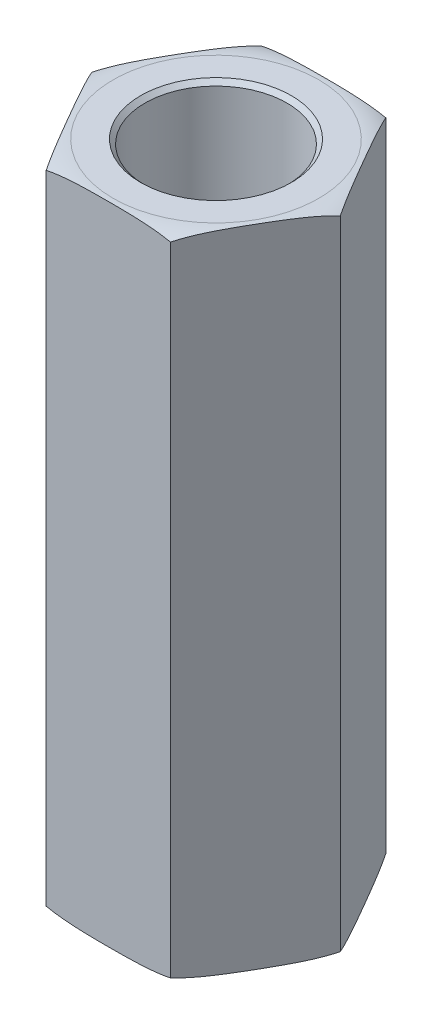
ISO-10303-21;
HEADER;
FILE_DESCRIPTION(('STEP AP214'),'2;1');
FILE_NAME('part.step','',(''),(''),'','','');
FILE_SCHEMA(('AUTOMOTIVE_DESIGN { 1 0 10303 214 1 1 1 1 }'));
ENDSEC;
DATA;
#1=APPLICATION_CONTEXT('core data for automotive mechanical design processes');
#2=APPLICATION_PROTOCOL_DEFINITION('international standard','automotive_design',2000,#1);
#3=PRODUCT_CONTEXT('',#1,'mechanical');
#4=PRODUCT('Part','Part','',(#3));
#5=PRODUCT_RELATED_PRODUCT_CATEGORY('part','',(#4));
#6=PRODUCT_DEFINITION_FORMATION('','',#4);
#7=PRODUCT_DEFINITION_CONTEXT('part definition',#1,'design');
#8=PRODUCT_DEFINITION('design','',#6,#7);
#9=PRODUCT_DEFINITION_SHAPE('','',#8);
#10=(LENGTH_UNIT() NAMED_UNIT(*) SI_UNIT(.MILLI.,.METRE.));
#11=(NAMED_UNIT(*) PLANE_ANGLE_UNIT() SI_UNIT($,.RADIAN.));
#12=(NAMED_UNIT(*) SI_UNIT($,.STERADIAN.) SOLID_ANGLE_UNIT());
#13=UNCERTAINTY_MEASURE_WITH_UNIT(LENGTH_MEASURE(1.E-05),#10,'distance_accuracy_value','');
#14=(GEOMETRIC_REPRESENTATION_CONTEXT(3) GLOBAL_UNCERTAINTY_ASSIGNED_CONTEXT((#13)) GLOBAL_UNIT_ASSIGNED_CONTEXT((#10,
#11,#12)) REPRESENTATION_CONTEXT('',''));
#15=CARTESIAN_POINT('',(0.,0.,0.));
#16=DIRECTION('',(0.,0.,1.));
#17=DIRECTION('',(1.,0.,0.));
#18=AXIS2_PLACEMENT_3D('',#15,#16,#17);
#19=CARTESIAN_POINT('',(3.66617420935412,9.525,0.));
#20=DIRECTION('',(-0.866025403784439,0.,0.5));
#21=DIRECTION('',(0.5,0.,0.866025403784439));
#22=AXIS2_PLACEMENT_3D('',#19,#20,#21);
#23=PLANE('',#22);
#24=DIRECTION('',(0.,1.,0.));
#25=VECTOR('',#24,1.);
#26=CARTESIAN_POINT('',(1.83308710467705,9.525,-3.175));
#27=LINE('',#26,#25);
#28=CARTESIAN_POINT('',(1.83308710467705,-9.398,-3.175));
#29=VERTEX_POINT('',#28);
#30=CARTESIAN_POINT('',(1.83308710467706,9.398,-3.175));
#31=VERTEX_POINT('',#30);
#32=EDGE_CURVE('E143',#29,#31,#27,.T.);
#33=ORIENTED_EDGE('',*,*,#32,.T.);
#34=CARTESIAN_POINT('',(3.66617420935412,9.398,0.));
#35=CARTESIAN_POINT('',(3.62797961467395,9.41390141489969,-0.0661549785605542));
#36=CARTESIAN_POINT('',(3.58956810864157,9.4274886076105,-0.132685658603869));
#37=CARTESIAN_POINT('',(3.51249051795711,9.45081619794021,-0.266187961794349));
#38=CARTESIAN_POINT('',(3.47382473049847,9.46056047713974,-0.333159070187379));
#39=CARTESIAN_POINT('',(3.39641631867874,9.4769966530451,-0.467234372392366));
#40=CARTESIAN_POINT('',(3.35767399633313,9.48369453286691,-0.534338043098168));
#41=CARTESIAN_POINT('',(3.28009834620114,9.4947767572932,-0.668703010556962));
#42=CARTESIAN_POINT('',(3.24126499587772,9.49916045047396,-0.735964346345247));
#43=CARTESIAN_POINT('',(3.16354065964316,9.50624030042628,-0.870586845688074));
#44=CARTESIAN_POINT('',(3.12464965374477,9.50893552375912,-0.937948043861543));
#45=CARTESIAN_POINT('',(3.04685144594594,9.51315319837134,-1.07269849250692));
#46=CARTESIAN_POINT('',(3.00794424351971,9.51467560802717,-1.14008774388952));
#47=CARTESIAN_POINT('',(2.93051517598875,9.51692270588903,-1.27419882283583));
#48=CARTESIAN_POINT('',(2.89199336248936,9.51765524681809,-1.34092056101645));
#49=CARTESIAN_POINT('',(2.81494778346146,9.51857673025742,-1.47436741839135));
#50=CARTESIAN_POINT('',(2.77642401791441,9.51876566589491,-1.5410925376177));
#51=CARTESIAN_POINT('',(2.69935964431015,9.51866599668056,-1.67457194815376));
#52=CARTESIAN_POINT('',(2.66081903631824,9.51837718117656,-1.74132623935034));
#53=CARTESIAN_POINT('',(2.58373908085332,9.517221986219,-1.87483263846072));
#54=CARTESIAN_POINT('',(2.54519973341248,9.51635559703857,-1.94158474631881));
#55=CARTESIAN_POINT('',(2.46812969629774,9.51378619406564,-2.07507396634277));
#56=CARTESIAN_POINT('',(2.42959900625968,9.51208322716166,-2.14181107913937));
#57=CARTESIAN_POINT('',(2.35255651340912,9.50743872297261,-2.27525259109831));
#58=CARTESIAN_POINT('',(2.31404470975446,9.50449724713581,-2.34195699171929));
#59=CARTESIAN_POINT('',(2.25084206239948,9.49821741247489,-2.45142718811098));
#60=CARTESIAN_POINT('',(2.22613849337013,9.49539801104633,-2.4942150247981));
#61=CARTESIAN_POINT('',(2.1767694527223,9.48886967943037,-2.57972471152106));
#62=CARTESIAN_POINT('',(2.15210397034186,9.48516108091391,-2.62244658019719));
#63=CARTESIAN_POINT('',(2.10282753811698,9.4766802711497,-2.70779586442641));
#64=CARTESIAN_POINT('',(2.07821657107531,9.47190846570085,-2.75042330976598));
#65=CARTESIAN_POINT('',(2.02900094683551,9.4610987712516,-2.83566727147553));
#66=CARTESIAN_POINT('',(2.00439646085464,9.45505773130843,-2.87828349128851));
#67=CARTESIAN_POINT('',(1.95527325900934,9.44151383541612,-2.96336737271503));
#68=CARTESIAN_POINT('',(1.93075459617615,9.43401019780297,-3.00583494247578));
#69=CARTESIAN_POINT('',(1.88182157373171,9.41732035070844,-3.09058942351744));
#70=CARTESIAN_POINT('',(1.85740744053269,9.40813149780328,-3.1328759426409));
#71=CARTESIAN_POINT('',(1.83308710467706,9.398,-3.175));
#72=B_SPLINE_CURVE_WITH_KNOTS('',3,(#34,#35,#36,#37,#38,#39,#40,#41,#42,#43,#44,#45,#46,#47,#48,
#49,#50,#51,#52,#53,#54,#55,#56,#57,#58,#59,#60,#61,#62,#63,#64,#65,#66,#67,#68,#69,#70,#71),
.UNSPECIFIED.,.F.,.F.,(4,2,2,2,2,2,2,2,2,2,2,2,2,2,2,2,2,2,4),(0.,0.233977307817935,
0.467717675040681,0.70099697355748,0.934341903229723,1.16781571967236,1.40129782179821,
1.63243665809665,1.86357841666612,2.09482211846288,2.32606971471488,2.5573043514739,
2.78852751694405,2.93698369265081,3.08538458004469,3.23372892334581,3.3824459854661,
3.53124274626083,3.68027493713586),.UNSPECIFIED.);
#73=CARTESIAN_POINT('',(3.66617420935412,9.398,0.));
#74=VERTEX_POINT('',#73);
#75=EDGE_CURVE('E97',#74,#31,#72,.T.);
#76=ORIENTED_EDGE('',*,*,#75,.F.);
#77=DIRECTION('',(0.,1.,0.));
#78=VECTOR('',#77,1.);
#79=CARTESIAN_POINT('',(3.66617420935412,9.525,0.));
#80=LINE('',#79,#78);
#81=CARTESIAN_POINT('',(3.66617420935412,-9.398,0.));
#82=VERTEX_POINT('',#81);
#83=EDGE_CURVE('E145',#74,#82,#80,.F.);
#84=ORIENTED_EDGE('',*,*,#83,.T.);
#85=CARTESIAN_POINT('',(1.83308710467705,-9.398,-3.17500000000001));
#86=CARTESIAN_POINT('',(1.87128169935722,-9.41390141489968,-3.10884502143945));
#87=CARTESIAN_POINT('',(1.9096932053896,-9.4274886076105,-3.04231434139614));
#88=CARTESIAN_POINT('',(1.98677079607406,-9.4508161979402,-2.90881203820566));
#89=CARTESIAN_POINT('',(2.0254365835327,-9.46056047713973,-2.84184092981263));
#90=CARTESIAN_POINT('',(2.10284499535243,-9.47699665304509,-2.70776562760765));
#91=CARTESIAN_POINT('',(2.14158731769803,-9.48369453286691,-2.64066195690184));
#92=CARTESIAN_POINT('',(2.21916296783002,-9.49477675729319,-2.50629698944305));
#93=CARTESIAN_POINT('',(2.25799631815344,-9.49916045047396,-2.43903565365477));
#94=CARTESIAN_POINT('',(2.335720654388,-9.50624030042628,-2.30441315431194));
#95=CARTESIAN_POINT('',(2.37461166028639,-9.50893552375912,-2.23705195613848));
#96=CARTESIAN_POINT('',(2.45240986808522,-9.51315319837134,-2.10230150749311));
#97=CARTESIAN_POINT('',(2.49131707051145,-9.51467560802717,-2.0349122561105));
#98=CARTESIAN_POINT('',(2.56874613804241,-9.51692270588903,-1.9008011771642));
#99=CARTESIAN_POINT('',(2.6072679515418,-9.51765524681809,-1.83407943898357));
#100=CARTESIAN_POINT('',(2.6843135305697,-9.51857673025742,-1.70063258160867));
#101=CARTESIAN_POINT('',(2.72283729611674,-9.51876566589491,-1.63390746238233));
#102=CARTESIAN_POINT('',(2.79990166972101,-9.51866599668056,-1.50042805184627));
#103=CARTESIAN_POINT('',(2.83844227771292,-9.51837718117656,-1.43367376064969));
#104=CARTESIAN_POINT('',(2.91552223317783,-9.517221986219,-1.30016736153931));
#105=CARTESIAN_POINT('',(2.95406158061867,-9.51635559703857,-1.23341525368122));
#106=CARTESIAN_POINT('',(3.03113161773342,-9.51378619406564,-1.09992603365727));
#107=CARTESIAN_POINT('',(3.06966230777147,-9.51208322716166,-1.03318892086067));
#108=CARTESIAN_POINT('',(3.14670480062203,-9.50743872297261,-0.899747408901733));
#109=CARTESIAN_POINT('',(3.18521660427669,-9.50449724713582,-0.83304300828075));
#110=CARTESIAN_POINT('',(3.24841925163167,-9.49821741247489,-0.723572811889063));
#111=CARTESIAN_POINT('',(3.27312282066102,-9.49539801104633,-0.680784975201942));
#112=CARTESIAN_POINT('',(3.32249186130885,-9.48886967943037,-0.595275288478971));
#113=CARTESIAN_POINT('',(3.3471573436893,-9.48516108091391,-0.552553419802841));
#114=CARTESIAN_POINT('',(3.39643377591418,-9.4766802711497,-0.46720413557362));
#115=CARTESIAN_POINT('',(3.42104474295585,-9.47190846570085,-0.424576690234039));
#116=CARTESIAN_POINT('',(3.47026036719565,-9.4610987712516,-0.339332728524487));
#117=CARTESIAN_POINT('',(3.49486485317652,-9.45505773130843,-0.296716508711511));
#118=CARTESIAN_POINT('',(3.54398805502183,-9.44151383541613,-0.211632627284978));
#119=CARTESIAN_POINT('',(3.56850671785502,-9.43401019780297,-0.169165057524231));
#120=CARTESIAN_POINT('',(3.61743974029946,-9.41732035070845,-0.08441057648256));
#121=CARTESIAN_POINT('',(3.64185387349848,-9.40813149780329,-0.0421240573591054));
#122=CARTESIAN_POINT('',(3.66617420935412,-9.398,0.));
#123=B_SPLINE_CURVE_WITH_KNOTS('',3,(#85,#86,#87,#88,#89,#90,#91,#92,#93,#94,#95,#96,#97,#98,
#99,#100,#101,#102,#103,#104,#105,#106,#107,#108,#109,#110,#111,#112,#113,#114,#115,#116,#117,
#118,#119,#120,#121,#122),.UNSPECIFIED.,.F.,.F.,(4,2,2,2,2,2,2,2,2,2,2,2,2,2,2,2,2,2,4),(0.,
0.233977307817932,0.467717675040674,0.700996973557469,0.934341903229708,1.16781571967234,
1.40129782179818,1.63243665809662,1.86357841666608,2.09482211846285,2.32606971471484,
2.55730435147386,2.78852751694401,2.93698369265077,3.08538458004466,3.23372892334579,
3.38244598546609,3.53124274626083,3.68027493713586),.UNSPECIFIED.);
#124=EDGE_CURVE('E221',#29,#82,#123,.T.);
#125=ORIENTED_EDGE('',*,*,#124,.F.);
#126=EDGE_LOOP('',(#33,#76,#84,#125));
#127=FACE_BOUND('',#126,.T.);
#128=ADVANCED_FACE('F17',(#127),#23,.F.);
#129=CARTESIAN_POINT('',(1.83308710467706,9.525,3.17499999999999));
#130=DIRECTION('',(-0.866025403784439,0.,-0.5));
#131=DIRECTION('',(-0.5,0.,0.866025403784439));
#132=AXIS2_PLACEMENT_3D('',#129,#130,#131);
#133=PLANE('',#132);
#134=ORIENTED_EDGE('',*,*,#83,.F.);
#135=CARTESIAN_POINT('',(1.83308710467706,9.398,3.17499999999999));
#136=CARTESIAN_POINT('',(1.87128169935724,9.41390141489969,3.10884502143943));
#137=CARTESIAN_POINT('',(1.90969320538961,9.4274886076105,3.04231434139612));
#138=CARTESIAN_POINT('',(1.98677079607407,9.45081619794021,2.90881203820564));
#139=CARTESIAN_POINT('',(2.02543658353271,9.46056047713974,2.84184092981261));
#140=CARTESIAN_POINT('',(2.10284499535245,9.4769966530451,2.70776562760762));
#141=CARTESIAN_POINT('',(2.14158731769805,9.48369453286691,2.64066195690182));
#142=CARTESIAN_POINT('',(2.21916296783004,9.4947767572932,2.50629698944302));
#143=CARTESIAN_POINT('',(2.25799631815346,9.49916045047396,2.43903565365474));
#144=CARTESIAN_POINT('',(2.33572065438802,9.50624030042628,2.30441315431191));
#145=CARTESIAN_POINT('',(2.37461166028641,9.50893552375912,2.23705195613844));
#146=CARTESIAN_POINT('',(2.45240986808524,9.51315319837134,2.10230150749307));
#147=CARTESIAN_POINT('',(2.49131707051148,9.51467560802717,2.03491225611046));
#148=CARTESIAN_POINT('',(2.56874613804244,9.51692270588903,1.90080117716416));
#149=CARTESIAN_POINT('',(2.60726795154182,9.51765524681809,1.83407943898353));
#150=CARTESIAN_POINT('',(2.68431353056973,9.51857673025742,1.70063258160863));
#151=CARTESIAN_POINT('',(2.72283729611677,9.51876566589491,1.63390746238228));
#152=CARTESIAN_POINT('',(2.79990166972104,9.51866599668056,1.50042805184622));
#153=CARTESIAN_POINT('',(2.83844227771295,9.51837718117656,1.43367376064964));
#154=CARTESIAN_POINT('',(2.91552223317786,9.517221986219,1.30016736153926));
#155=CARTESIAN_POINT('',(2.95406158061871,9.51635559703857,1.23341525368117));
#156=CARTESIAN_POINT('',(3.03113161773345,9.51378619406564,1.09992603365721));
#157=CARTESIAN_POINT('',(3.06966230777151,9.51208322716166,1.03318892086061));
#158=CARTESIAN_POINT('',(3.14670480062207,9.50743872297261,0.899747408901672));
#159=CARTESIAN_POINT('',(3.18521660427673,9.50449724713581,0.833043008280688));
#160=CARTESIAN_POINT('',(3.24841925163171,9.49821741247489,0.723572811889004));
#161=CARTESIAN_POINT('',(3.27312282066106,9.49539801104633,0.680784975201887));
#162=CARTESIAN_POINT('',(3.32249186130888,9.48886967943037,0.595275288478923));
#163=CARTESIAN_POINT('',(3.34715734368933,9.48516108091391,0.552553419802797));
#164=CARTESIAN_POINT('',(3.3964337759142,9.4766802711497,0.467204135573584));
#165=CARTESIAN_POINT('',(3.42104474295588,9.47190846570085,0.424576690234007));
#166=CARTESIAN_POINT('',(3.47026036719567,9.4610987712516,0.339332728524462));
#167=CARTESIAN_POINT('',(3.49486485317654,9.45505773130843,0.296716508711489));
#168=CARTESIAN_POINT('',(3.54398805502184,9.44151383541612,0.211632627284964));
#169=CARTESIAN_POINT('',(3.56850671785503,9.43401019780297,0.169165057524221));
#170=CARTESIAN_POINT('',(3.61743974029946,9.41732035070844,0.0844105764825579));
#171=CARTESIAN_POINT('',(3.64185387349848,9.40813149780328,0.042124057359107));
#172=CARTESIAN_POINT('',(3.66617420935412,9.398,0.));
#173=B_SPLINE_CURVE_WITH_KNOTS('',3,(#135,#136,#137,#138,#139,#140,#141,#142,#143,#144,#145,
#146,#147,#148,#149,#150,#151,#152,#153,#154,#155,#156,#157,#158,#159,#160,#161,#162,#163,#164,
#165,#166,#167,#168,#169,#170,#171,#172),.UNSPECIFIED.,.F.,.F.,(4,2,2,2,2,2,2,2,2,2,2,2,2,2,2,2,
2,2,4),(0.,0.233977307817936,0.467717675040682,0.700996973557482,0.934341903229727,
1.16781571967237,1.40129782179821,1.63243665809666,1.86357841666612,2.09482211846289,
2.32606971471489,2.55730435147391,2.78852751694406,2.93698369265081,3.08538458004469,
3.23372892334581,3.3824459854661,3.53124274626082,3.68027493713584),.UNSPECIFIED.);
#174=CARTESIAN_POINT('',(1.83308710467707,9.398,3.17499999999999));
#175=VERTEX_POINT('',#174);
#176=EDGE_CURVE('E214',#175,#74,#173,.T.);
#177=ORIENTED_EDGE('',*,*,#176,.F.);
#178=DIRECTION('',(0.,1.,0.));
#179=VECTOR('',#178,1.);
#180=CARTESIAN_POINT('',(1.83308710467707,9.525,3.17499999999999));
#181=LINE('',#180,#179);
#182=CARTESIAN_POINT('',(1.83308710467706,-9.398,3.17499999999999));
#183=VERTEX_POINT('',#182);
#184=EDGE_CURVE('E140',#175,#183,#181,.F.);
#185=ORIENTED_EDGE('',*,*,#184,.T.);
#186=CARTESIAN_POINT('',(3.66617420935412,-9.398,0.));
#187=CARTESIAN_POINT('',(3.62797961467395,-9.41390141489969,0.0661549785605599));
#188=CARTESIAN_POINT('',(3.58956810864157,-9.4274886076105,0.132685658603875));
#189=CARTESIAN_POINT('',(3.51249051795711,-9.45081619794021,0.266187961794355));
#190=CARTESIAN_POINT('',(3.47382473049847,-9.46056047713974,0.333159070187385));
#191=CARTESIAN_POINT('',(3.39641631867874,-9.4769966530451,0.467234372392373));
#192=CARTESIAN_POINT('',(3.35767399633313,-9.48369453286691,0.534338043098174));
#193=CARTESIAN_POINT('',(3.28009834620114,-9.4947767572932,0.668703010556968));
#194=CARTESIAN_POINT('',(3.24126499587772,-9.49916045047396,0.735964346345254));
#195=CARTESIAN_POINT('',(3.16354065964316,-9.50624030042628,0.87058684568808));
#196=CARTESIAN_POINT('',(3.12464965374477,-9.50893552375912,0.93794804386155));
#197=CARTESIAN_POINT('',(3.04685144594594,-9.51315319837134,1.07269849250692));
#198=CARTESIAN_POINT('',(3.00794424351971,-9.51467560802717,1.14008774388953));
#199=CARTESIAN_POINT('',(2.93051517598875,-9.51692270588903,1.27419882283583));
#200=CARTESIAN_POINT('',(2.89199336248936,-9.51765524681809,1.34092056101646));
#201=CARTESIAN_POINT('',(2.81494778346145,-9.51857673025742,1.47436741839136));
#202=CARTESIAN_POINT('',(2.77642401791441,-9.51876566589491,1.54109253761771));
#203=CARTESIAN_POINT('',(2.69935964431015,-9.51866599668056,1.67457194815377));
#204=CARTESIAN_POINT('',(2.66081903631824,-9.51837718117656,1.74132623935035));
#205=CARTESIAN_POINT('',(2.58373908085332,-9.517221986219,1.87483263846073));
#206=CARTESIAN_POINT('',(2.54519973341248,-9.51635559703857,1.94158474631882));
#207=CARTESIAN_POINT('',(2.46812969629773,-9.51378619406564,2.07507396634278));
#208=CARTESIAN_POINT('',(2.42959900625968,-9.51208322716166,2.14181107913938));
#209=CARTESIAN_POINT('',(2.35255651340911,-9.50743872297261,2.27525259109832));
#210=CARTESIAN_POINT('',(2.31404470975446,-9.50449724713581,2.3419569917193));
#211=CARTESIAN_POINT('',(2.25084206239948,-9.49821741247489,2.45142718811099));
#212=CARTESIAN_POINT('',(2.22613849337013,-9.49539801104633,2.4942150247981));
#213=CARTESIAN_POINT('',(2.1767694527223,-9.48886967943037,2.57972471152107));
#214=CARTESIAN_POINT('',(2.15210397034186,-9.48516108091391,2.62244658019719));
#215=CARTESIAN_POINT('',(2.10282753811698,-9.4766802711497,2.70779586442641));
#216=CARTESIAN_POINT('',(2.07821657107531,-9.47190846570085,2.75042330976598));
#217=CARTESIAN_POINT('',(2.02900094683551,-9.4610987712516,2.83566727147553));
#218=CARTESIAN_POINT('',(2.00439646085465,-9.45505773130843,2.8782834912885));
#219=CARTESIAN_POINT('',(1.95527325900934,-9.44151383541612,2.96336737271503));
#220=CARTESIAN_POINT('',(1.93075459617615,-9.43401019780296,3.00583494247577));
#221=CARTESIAN_POINT('',(1.88182157373172,-9.41732035070844,3.09058942351744));
#222=CARTESIAN_POINT('',(1.8574074405327,-9.40813149780329,3.13287594264089));
#223=CARTESIAN_POINT('',(1.83308710467706,-9.398,3.17499999999999));
#224=B_SPLINE_CURVE_WITH_KNOTS('',3,(#186,#187,#188,#189,#190,#191,#192,#193,#194,#195,#196,
#197,#198,#199,#200,#201,#202,#203,#204,#205,#206,#207,#208,#209,#210,#211,#212,#213,#214,#215,
#216,#217,#218,#219,#220,#221,#222,#223),.UNSPECIFIED.,.F.,.F.,(4,2,2,2,2,2,2,2,2,2,2,2,2,2,2,2,
2,2,4),(0.,0.233977307817936,0.467717675040682,0.700996973557481,0.934341903229725,
1.16781571967236,1.40129782179821,1.63243665809665,1.86357841666612,2.09482211846289,
2.32606971471488,2.55730435147391,2.78852751694405,2.93698369265081,3.08538458004468,
3.2337289233458,3.38244598546609,3.53124274626082,3.68027493713584),.UNSPECIFIED.);
#225=EDGE_CURVE('E240',#82,#183,#224,.T.);
#226=ORIENTED_EDGE('',*,*,#225,.F.);
#227=EDGE_LOOP('',(#134,#177,#185,#226));
#228=FACE_BOUND('',#227,.T.);
#229=ADVANCED_FACE('F218',(#228),#133,.F.);
#230=CARTESIAN_POINT('',(1.83308710467706,9.525,-3.175));
#231=DIRECTION('',(0.,0.,1.));
#232=DIRECTION('',(1.,0.,0.));
#233=AXIS2_PLACEMENT_3D('',#230,#231,#232);
#234=PLANE('',#233);
#235=DIRECTION('',(0.,1.,0.));
#236=VECTOR('',#235,1.);
#237=CARTESIAN_POINT('',(-1.83308710467707,9.525,-3.175));
#238=LINE('',#237,#236);
#239=CARTESIAN_POINT('',(-1.83308710467707,-9.39799999999999,-3.175));
#240=VERTEX_POINT('',#239);
#241=CARTESIAN_POINT('',(-1.83308710467706,9.398,-3.17500000000001));
#242=VERTEX_POINT('',#241);
#243=EDGE_CURVE('E104',#240,#242,#238,.T.);
#244=ORIENTED_EDGE('',*,*,#243,.T.);
#245=CARTESIAN_POINT('',(1.83308710467706,9.398,-3.175));
#246=CARTESIAN_POINT('',(1.73237579828683,9.41894001415179,-3.175));
#247=CARTESIAN_POINT('',(1.63096506893486,9.43588534953273,-3.175));
#248=CARTESIAN_POINT('',(1.42767146651469,9.46349716439842,-3.175));
#249=CARTESIAN_POINT('',(1.32579191427254,9.47418756587531,-3.175));
#250=CARTESIAN_POINT('',(1.12177634709137,9.49112804080793,-3.175));
#251=CARTESIAN_POINT('',(1.0196405664338,9.49738127071887,-3.175));
#252=CARTESIAN_POINT('',(0.815663681397375,9.50690280641833,-3.175));
#253=CARTESIAN_POINT('',(0.713823115514573,9.5101834044999,-3.175));
#254=CARTESIAN_POINT('',(0.510018485441651,9.51494548487028,-3.175));
#255=CARTESIAN_POINT('',(0.408054390577976,9.51642541008817,-3.175));
#256=CARTESIAN_POINT('',(0.20406020033787,9.51831468183793,-3.175));
#257=CARTESIAN_POINT('',(0.102030100168935,9.51872342414921,-3.175));
#258=CARTESIAN_POINT('',(-0.102030100168934,9.51872342414921,-3.175));
#259=CARTESIAN_POINT('',(-0.204060200337869,9.51831468183793,-3.175));
#260=CARTESIAN_POINT('',(-0.408054390577975,9.51642541008817,-3.175));
#261=CARTESIAN_POINT('',(-0.510018485441649,9.51494548487028,-3.175));
#262=CARTESIAN_POINT('',(-0.713823115514571,9.5101834044999,-3.175));
#263=CARTESIAN_POINT('',(-0.815663681397373,9.50690280641833,-3.175));
#264=CARTESIAN_POINT('',(-1.01964056643379,9.49738127071887,-3.175));
#265=CARTESIAN_POINT('',(-1.12177634709137,9.49112804080793,-3.175));
#266=CARTESIAN_POINT('',(-1.32579191427253,9.47418756587531,-3.175));
#267=CARTESIAN_POINT('',(-1.42767146651469,9.46349716439842,-3.175));
#268=CARTESIAN_POINT('',(-1.63096506893485,9.43588534953273,-3.175));
#269=CARTESIAN_POINT('',(-1.73237579828683,9.41894001415179,-3.175));
#270=CARTESIAN_POINT('',(-1.83308710467705,9.398,-3.17500000000001));
#271=B_SPLINE_CURVE_WITH_KNOTS('',3,(#245,#246,#247,#248,#249,#250,#251,#252,#253,#254,#255,
#256,#257,#258,#259,#260,#261,#262,#263,#264,#265,#266,#267,#268,#269,#270),.UNSPECIFIED.,.F.,
.F.,(4,2,2,2,2,2,2,2,2,2,2,2,4),(0.,0.308333242342807,0.615479423308234,0.922406891130008,
1.2280592962085,1.53397581645216,1.84006485747889,2.14615389850561,2.45207041874927,
2.75772282382776,3.06465029164954,3.37179647261496,3.68012971495777),.UNSPECIFIED.);
#272=EDGE_CURVE('E89',#31,#242,#271,.T.);
#273=ORIENTED_EDGE('',*,*,#272,.F.);
#274=ORIENTED_EDGE('',*,*,#32,.F.);
#275=CARTESIAN_POINT('',(-1.83308710467707,-9.39799999999999,-3.175));
#276=CARTESIAN_POINT('',(-1.73237579828684,-9.41894001415179,-3.175));
#277=CARTESIAN_POINT('',(-1.63096506893487,-9.43588534953273,-3.175));
#278=CARTESIAN_POINT('',(-1.4276714665147,-9.46349716439842,-3.175));
#279=CARTESIAN_POINT('',(-1.32579191427255,-9.47418756587531,-3.175));
#280=CARTESIAN_POINT('',(-1.12177634709138,-9.49112804080793,-3.175));
#281=CARTESIAN_POINT('',(-1.0196405664338,-9.49738127071887,-3.175));
#282=CARTESIAN_POINT('',(-0.81566368139738,-9.50690280641833,-3.175));
#283=CARTESIAN_POINT('',(-0.713823115514577,-9.5101834044999,-3.175));
#284=CARTESIAN_POINT('',(-0.510018485441654,-9.51494548487028,-3.175));
#285=CARTESIAN_POINT('',(-0.408054390577979,-9.51642541008817,-3.175));
#286=CARTESIAN_POINT('',(-0.204060200337872,-9.51831468183793,-3.175));
#287=CARTESIAN_POINT('',(-0.102030100168936,-9.51872342414921,-3.175));
#288=CARTESIAN_POINT('',(0.102030100168934,-9.51872342414921,-3.175));
#289=CARTESIAN_POINT('',(0.204060200337869,-9.51831468183793,-3.175));
#290=CARTESIAN_POINT('',(0.408054390577974,-9.51642541008817,-3.175));
#291=CARTESIAN_POINT('',(0.510018485441648,-9.51494548487028,-3.175));
#292=CARTESIAN_POINT('',(0.713823115514568,-9.5101834044999,-3.175));
#293=CARTESIAN_POINT('',(0.81566368139737,-9.50690280641833,-3.175));
#294=CARTESIAN_POINT('',(1.01964056643379,-9.49738127071887,-3.175));
#295=CARTESIAN_POINT('',(1.12177634709137,-9.49112804080794,-3.175));
#296=CARTESIAN_POINT('',(1.32579191427253,-9.47418756587531,-3.175));
#297=CARTESIAN_POINT('',(1.42767146651468,-9.46349716439843,-3.175));
#298=CARTESIAN_POINT('',(1.63096506893485,-9.43588534953273,-3.175));
#299=CARTESIAN_POINT('',(1.73237579828682,-9.41894001415179,-3.175));
#300=CARTESIAN_POINT('',(1.83308710467705,-9.398,-3.175));
#301=B_SPLINE_CURVE_WITH_KNOTS('',3,(#275,#276,#277,#278,#279,#280,#281,#282,#283,#284,#285,
#286,#287,#288,#289,#290,#291,#292,#293,#294,#295,#296,#297,#298,#299,#300),.UNSPECIFIED.,.F.,
.F.,(4,2,2,2,2,2,2,2,2,2,2,2,4),(0.,0.308333242342809,0.615479423308238,0.922406891130013,
1.22805929620851,1.53397581645217,1.8400648574789,2.14615389850562,2.45207041874928,
2.75772282382777,3.06465029164954,3.37179647261497,3.68012971495777),.UNSPECIFIED.);
#302=EDGE_CURVE('E106',#240,#29,#301,.T.);
#303=ORIENTED_EDGE('',*,*,#302,.F.);
#304=EDGE_LOOP('',(#244,#273,#274,#303));
#305=FACE_BOUND('',#304,.T.);
#306=ADVANCED_FACE('F105',(#305),#234,.F.);
#307=CARTESIAN_POINT('',(-1.83308710467707,9.525,3.175));
#308=DIRECTION('',(0.,0.,-1.));
#309=DIRECTION('',(-1.,0.,0.));
#310=AXIS2_PLACEMENT_3D('',#307,#308,#309);
#311=PLANE('',#310);
#312=ORIENTED_EDGE('',*,*,#184,.F.);
#313=CARTESIAN_POINT('',(-1.83308710467706,9.398,3.175));
#314=CARTESIAN_POINT('',(-1.73237579828684,9.41894001415179,3.175));
#315=CARTESIAN_POINT('',(-1.63096506893486,9.43588534953273,3.175));
#316=CARTESIAN_POINT('',(-1.42767146651469,9.46349716439843,3.175));
#317=CARTESIAN_POINT('',(-1.32579191427254,9.47418756587531,3.175));
#318=CARTESIAN_POINT('',(-1.12177634709138,9.49112804080793,3.175));
#319=CARTESIAN_POINT('',(-1.0196405664338,9.49738127071888,3.175));
#320=CARTESIAN_POINT('',(-0.815663681397378,9.50690280641833,3.175));
#321=CARTESIAN_POINT('',(-0.713823115514575,9.5101834044999,3.175));
#322=CARTESIAN_POINT('',(-0.510018485441652,9.51494548487029,3.175));
#323=CARTESIAN_POINT('',(-0.408054390577978,9.51642541008817,3.175));
#324=CARTESIAN_POINT('',(-0.204060200337871,9.51831468183793,3.175));
#325=CARTESIAN_POINT('',(-0.102030100168935,9.51872342414921,3.17499999999999));
#326=CARTESIAN_POINT('',(0.102030100168936,9.51872342414921,3.17499999999999));
#327=CARTESIAN_POINT('',(0.204060200337871,9.51831468183793,3.17499999999999));
#328=CARTESIAN_POINT('',(0.408054390577978,9.51642541008817,3.17499999999999));
#329=CARTESIAN_POINT('',(0.510018485441653,9.51494548487029,3.17499999999999));
#330=CARTESIAN_POINT('',(0.713823115514576,9.5101834044999,3.17499999999999));
#331=CARTESIAN_POINT('',(0.815663681397379,9.50690280641833,3.17499999999999));
#332=CARTESIAN_POINT('',(1.0196405664338,9.49738127071888,3.17499999999999));
#333=CARTESIAN_POINT('',(1.12177634709138,9.49112804080794,3.17499999999999));
#334=CARTESIAN_POINT('',(1.32579191427254,9.47418756587531,3.17499999999999));
#335=CARTESIAN_POINT('',(1.4276714665147,9.46349716439843,3.17499999999999));
#336=CARTESIAN_POINT('',(1.63096506893486,9.43588534953273,3.17499999999999));
#337=CARTESIAN_POINT('',(1.73237579828684,9.41894001415179,3.17499999999999));
#338=CARTESIAN_POINT('',(1.83308710467707,9.398,3.17499999999999));
#339=B_SPLINE_CURVE_WITH_KNOTS('',3,(#313,#314,#315,#316,#317,#318,#319,#320,#321,#322,#323,
#324,#325,#326,#327,#328,#329,#330,#331,#332,#333,#334,#335,#336,#337,#338),.UNSPECIFIED.,.F.,
.F.,(4,2,2,2,2,2,2,2,2,2,2,2,4),(0.,0.308333242342809,0.615479423308237,0.922406891130012,
1.2280592962085,1.53397581645216,1.84006485747889,2.14615389850562,2.45207041874928,
2.75772282382778,3.06465029164955,3.37179647261498,3.68012971495779),.UNSPECIFIED.);
#340=CARTESIAN_POINT('',(-1.83308710467707,9.398,3.175));
#341=VERTEX_POINT('',#340);
#342=EDGE_CURVE('E100',#341,#175,#339,.T.);
#343=ORIENTED_EDGE('',*,*,#342,.F.);
#344=DIRECTION('',(0.,1.,0.));
#345=VECTOR('',#344,1.);
#346=CARTESIAN_POINT('',(-1.83308710467707,9.525,3.175));
#347=LINE('',#346,#345);
#348=CARTESIAN_POINT('',(-1.83308710467706,-9.398,3.175));
#349=VERTEX_POINT('',#348);
#350=EDGE_CURVE('E108',#341,#349,#347,.F.);
#351=ORIENTED_EDGE('',*,*,#350,.T.);
#352=CARTESIAN_POINT('',(1.83308710467706,-9.398,3.17499999999999));
#353=CARTESIAN_POINT('',(1.73237579828684,-9.41894001415179,3.17499999999999));
#354=CARTESIAN_POINT('',(1.63096506893486,-9.43588534953273,3.17499999999999));
#355=CARTESIAN_POINT('',(1.4276714665147,-9.46349716439843,3.17499999999999));
#356=CARTESIAN_POINT('',(1.32579191427254,-9.47418756587531,3.17499999999999));
#357=CARTESIAN_POINT('',(1.12177634709138,-9.49112804080793,3.17499999999999));
#358=CARTESIAN_POINT('',(1.0196405664338,-9.49738127071888,3.17499999999999));
#359=CARTESIAN_POINT('',(0.815663681397379,-9.50690280641833,3.17499999999999));
#360=CARTESIAN_POINT('',(0.713823115514576,-9.5101834044999,3.17499999999999));
#361=CARTESIAN_POINT('',(0.510018485441653,-9.51494548487029,3.17499999999999));
#362=CARTESIAN_POINT('',(0.408054390577978,-9.51642541008817,3.17499999999999));
#363=CARTESIAN_POINT('',(0.204060200337871,-9.51831468183793,3.17499999999999));
#364=CARTESIAN_POINT('',(0.102030100168935,-9.51872342414921,3.17499999999999));
#365=CARTESIAN_POINT('',(-0.102030100168935,-9.51872342414921,3.17499999999999));
#366=CARTESIAN_POINT('',(-0.204060200337871,-9.51831468183793,3.175));
#367=CARTESIAN_POINT('',(-0.408054390577977,-9.51642541008817,3.175));
#368=CARTESIAN_POINT('',(-0.510018485441652,-9.51494548487029,3.175));
#369=CARTESIAN_POINT('',(-0.713823115514575,-9.5101834044999,3.175));
#370=CARTESIAN_POINT('',(-0.815663681397378,-9.50690280641833,3.175));
#371=CARTESIAN_POINT('',(-1.0196405664338,-9.49738127071888,3.175));
#372=CARTESIAN_POINT('',(-1.12177634709138,-9.49112804080793,3.175));
#373=CARTESIAN_POINT('',(-1.32579191427254,-9.47418756587531,3.175));
#374=CARTESIAN_POINT('',(-1.42767146651469,-9.46349716439843,3.175));
#375=CARTESIAN_POINT('',(-1.63096506893486,-9.43588534953273,3.175));
#376=CARTESIAN_POINT('',(-1.73237579828684,-9.41894001415179,3.175));
#377=CARTESIAN_POINT('',(-1.83308710467706,-9.398,3.175));
#378=B_SPLINE_CURVE_WITH_KNOTS('',3,(#352,#353,#354,#355,#356,#357,#358,#359,#360,#361,#362,
#363,#364,#365,#366,#367,#368,#369,#370,#371,#372,#373,#374,#375,#376,#377),.UNSPECIFIED.,.F.,
.F.,(4,2,2,2,2,2,2,2,2,2,2,2,4),(0.,0.308333242342809,0.615479423308237,0.922406891130013,
1.22805929620851,1.53397581645217,1.84006485747889,2.14615389850562,2.45207041874928,
2.75772282382778,3.06465029164955,3.37179647261498,3.68012971495779),.UNSPECIFIED.);
#379=EDGE_CURVE('E208',#183,#349,#378,.T.);
#380=ORIENTED_EDGE('',*,*,#379,.F.);
#381=EDGE_LOOP('',(#312,#343,#351,#380));
#382=FACE_BOUND('',#381,.T.);
#383=ADVANCED_FACE('F369',(#382),#311,.F.);
#384=CARTESIAN_POINT('',(-3.66617420935413,9.525,0.));
#385=DIRECTION('',(0.866025403784439,0.,-0.499999999999999));
#386=DIRECTION('',(-0.499999999999999,0.,-0.866025403784439));
#387=AXIS2_PLACEMENT_3D('',#384,#385,#386);
#388=PLANE('',#387);
#389=ORIENTED_EDGE('',*,*,#350,.F.);
#390=CARTESIAN_POINT('',(-3.66617420935412,9.398,0.));
#391=CARTESIAN_POINT('',(-3.62797961467395,9.41390141489969,0.0661549785605627));
#392=CARTESIAN_POINT('',(-3.58956810864157,9.4274886076105,0.132685658603878));
#393=CARTESIAN_POINT('',(-3.51249051795711,9.4508161979402,0.266187961794359));
#394=CARTESIAN_POINT('',(-3.47382473049847,9.46056047713974,0.333159070187389));
#395=CARTESIAN_POINT('',(-3.39641631867874,9.47699665304509,0.467234372392377));
#396=CARTESIAN_POINT('',(-3.35767399633313,9.48369453286691,0.534338043098178));
#397=CARTESIAN_POINT('',(-3.28009834620114,9.49477675729319,0.668703010556972));
#398=CARTESIAN_POINT('',(-3.24126499587772,9.49916045047396,0.735964346345258));
#399=CARTESIAN_POINT('',(-3.16354065964316,9.50624030042628,0.870586845688085));
#400=CARTESIAN_POINT('',(-3.12464965374477,9.50893552375912,0.937948043861555));
#401=CARTESIAN_POINT('',(-3.04685144594594,9.51315319837134,1.07269849250693));
#402=CARTESIAN_POINT('',(-3.00794424351971,9.51467560802717,1.14008774388953));
#403=CARTESIAN_POINT('',(-2.93051517598875,9.51692270588903,1.27419882283584));
#404=CARTESIAN_POINT('',(-2.89199336248936,9.51765524681809,1.34092056101647));
#405=CARTESIAN_POINT('',(-2.81494778346146,9.51857673025742,1.47436741839137));
#406=CARTESIAN_POINT('',(-2.77642401791441,9.5187656658949,1.54109253761772));
#407=CARTESIAN_POINT('',(-2.69935964431015,9.51866599668056,1.67457194815378));
#408=CARTESIAN_POINT('',(-2.66081903631824,9.51837718117656,1.74132623935036));
#409=CARTESIAN_POINT('',(-2.58373908085332,9.517221986219,1.87483263846074));
#410=CARTESIAN_POINT('',(-2.54519973341248,9.51635559703857,1.94158474631883));
#411=CARTESIAN_POINT('',(-2.46812969629774,9.51378619406564,2.07507396634279));
#412=CARTESIAN_POINT('',(-2.42959900625968,9.51208322716166,2.14181107913938));
#413=CARTESIAN_POINT('',(-2.35255651340912,9.50743872297261,2.27525259109832));
#414=CARTESIAN_POINT('',(-2.31404470975446,9.50449724713581,2.34195699171931));
#415=CARTESIAN_POINT('',(-2.25084206239948,9.49821741247489,2.45142718811099));
#416=CARTESIAN_POINT('',(-2.22613849337013,9.49539801104632,2.49421502479811));
#417=CARTESIAN_POINT('',(-2.17676945272231,9.48886967943037,2.57972471152108));
#418=CARTESIAN_POINT('',(-2.15210397034186,9.48516108091391,2.6224465801972));
#419=CARTESIAN_POINT('',(-2.10282753811698,9.47668027114969,2.70779586442642));
#420=CARTESIAN_POINT('',(-2.07821657107531,9.47190846570085,2.75042330976599));
#421=CARTESIAN_POINT('',(-2.02900094683551,9.4610987712516,2.83566727147554));
#422=CARTESIAN_POINT('',(-2.00439646085465,9.45505773130842,2.87828349128851));
#423=CARTESIAN_POINT('',(-1.95527325900935,9.44151383541612,2.96336737271504));
#424=CARTESIAN_POINT('',(-1.93075459617615,9.43401019780296,3.00583494247578));
#425=CARTESIAN_POINT('',(-1.88182157373172,9.41732035070844,3.09058942351745));
#426=CARTESIAN_POINT('',(-1.8574074405327,9.40813149780328,3.1328759426409));
#427=CARTESIAN_POINT('',(-1.83308710467707,9.398,3.175));
#428=B_SPLINE_CURVE_WITH_KNOTS('',3,(#390,#391,#392,#393,#394,#395,#396,#397,#398,#399,#400,
#401,#402,#403,#404,#405,#406,#407,#408,#409,#410,#411,#412,#413,#414,#415,#416,#417,#418,#419,
#420,#421,#422,#423,#424,#425,#426,#427),.UNSPECIFIED.,.F.,.F.,(4,2,2,2,2,2,2,2,2,2,2,2,2,2,2,2,
2,2,4),(0.,0.233977307817936,0.467717675040682,0.700996973557482,0.934341903229725,
1.16781571967237,1.40129782179821,1.63243665809665,1.86357841666612,2.09482211846289,
2.32606971471489,2.55730435147391,2.78852751694406,2.93698369265081,3.08538458004469,
3.23372892334581,3.3824459854661,3.53124274626082,3.68027493713584),.UNSPECIFIED.);
#429=CARTESIAN_POINT('',(-3.66617420935413,9.398,0.));
#430=VERTEX_POINT('',#429);
#431=EDGE_CURVE('E101',#430,#341,#428,.T.);
#432=ORIENTED_EDGE('',*,*,#431,.F.);
#433=DIRECTION('',(0.,1.,0.));
#434=VECTOR('',#433,1.);
#435=CARTESIAN_POINT('',(-3.66617420935413,9.525,0.));
#436=LINE('',#435,#434);
#437=CARTESIAN_POINT('',(-3.66617420935412,-9.398,0.));
#438=VERTEX_POINT('',#437);
#439=EDGE_CURVE('E83',#430,#438,#436,.F.);
#440=ORIENTED_EDGE('',*,*,#439,.T.);
#441=CARTESIAN_POINT('',(-1.83308710467707,-9.398,3.175));
#442=CARTESIAN_POINT('',(-1.87128169935724,-9.41390141489968,3.10884502143945));
#443=CARTESIAN_POINT('',(-1.90969320538961,-9.4274886076105,3.04231434139613));
#444=CARTESIAN_POINT('',(-1.98677079607407,-9.4508161979402,2.90881203820565));
#445=CARTESIAN_POINT('',(-2.02543658353271,-9.46056047713973,2.84184092981263));
#446=CARTESIAN_POINT('',(-2.10284499535244,-9.47699665304509,2.70776562760764));
#447=CARTESIAN_POINT('',(-2.14158731769805,-9.48369453286691,2.64066195690184));
#448=CARTESIAN_POINT('',(-2.21916296783004,-9.49477675729319,2.50629698944305));
#449=CARTESIAN_POINT('',(-2.25799631815346,-9.49916045047396,2.43903565365476));
#450=CARTESIAN_POINT('',(-2.33572065438802,-9.50624030042628,2.30441315431194));
#451=CARTESIAN_POINT('',(-2.3746116602864,-9.50893552375912,2.23705195613847));
#452=CARTESIAN_POINT('',(-2.45240986808523,-9.51315319837134,2.1023015074931));
#453=CARTESIAN_POINT('',(-2.49131707051146,-9.51467560802717,2.0349122561105));
#454=CARTESIAN_POINT('',(-2.56874613804242,-9.51692270588903,1.90080117716419));
#455=CARTESIAN_POINT('',(-2.60726795154181,-9.51765524681809,1.83407943898357));
#456=CARTESIAN_POINT('',(-2.68431353056971,-9.51857673025742,1.70063258160867));
#457=CARTESIAN_POINT('',(-2.72283729611675,-9.51876566589491,1.63390746238232));
#458=CARTESIAN_POINT('',(-2.79990166972102,-9.51866599668056,1.50042805184626));
#459=CARTESIAN_POINT('',(-2.83844227771293,-9.51837718117656,1.43367376064968));
#460=CARTESIAN_POINT('',(-2.91552223317784,-9.517221986219,1.30016736153931));
#461=CARTESIAN_POINT('',(-2.95406158061869,-9.51635559703857,1.23341525368122));
#462=CARTESIAN_POINT('',(-3.03113161773343,-9.51378619406564,1.09992603365726));
#463=CARTESIAN_POINT('',(-3.06966230777148,-9.51208322716166,1.03318892086066));
#464=CARTESIAN_POINT('',(-3.14670480062204,-9.50743872297261,0.899747408901727));
#465=CARTESIAN_POINT('',(-3.1852166042767,-9.50449724713581,0.833043008280744));
#466=CARTESIAN_POINT('',(-3.24841925163168,-9.49821741247489,0.723572811889058));
#467=CARTESIAN_POINT('',(-3.27312282066103,-9.49539801104633,0.680784975201938));
#468=CARTESIAN_POINT('',(-3.32249186130886,-9.48886967943037,0.595275288478968));
#469=CARTESIAN_POINT('',(-3.34715734368931,-9.48516108091391,0.552553419802839));
#470=CARTESIAN_POINT('',(-3.39643377591419,-9.4766802711497,0.46720413557362));
#471=CARTESIAN_POINT('',(-3.42104474295586,-9.47190846570085,0.42457669023404));
#472=CARTESIAN_POINT('',(-3.47026036719566,-9.4610987712516,0.339332728524489));
#473=CARTESIAN_POINT('',(-3.49486485317653,-9.45505773130843,0.296716508711513));
#474=CARTESIAN_POINT('',(-3.54398805502183,-9.44151383541613,0.211632627284982));
#475=CARTESIAN_POINT('',(-3.56850671785503,-9.43401019780297,0.169165057524236));
#476=CARTESIAN_POINT('',(-3.61743974029946,-9.41732035070845,0.0844105764825669));
#477=CARTESIAN_POINT('',(-3.64185387349848,-9.40813149780329,0.042124057359113));
#478=CARTESIAN_POINT('',(-3.66617420935412,-9.398,0.));
#479=B_SPLINE_CURVE_WITH_KNOTS('',3,(#441,#442,#443,#444,#445,#446,#447,#448,#449,#450,#451,
#452,#453,#454,#455,#456,#457,#458,#459,#460,#461,#462,#463,#464,#465,#466,#467,#468,#469,#470,
#471,#472,#473,#474,#475,#476,#477,#478),.UNSPECIFIED.,.F.,.F.,(4,2,2,2,2,2,2,2,2,2,2,2,2,2,2,2,
2,2,4),(0.,0.233977307817931,0.467717675040673,0.700996973557468,0.934341903229707,
1.16781571967234,1.40129782179818,1.63243665809662,1.86357841666608,2.09482211846285,
2.32606971471484,2.55730435147386,2.788527516944,2.93698369265077,3.08538458004465,
3.23372892334578,3.38244598546608,3.53124274626081,3.68027493713584),.UNSPECIFIED.);
#480=EDGE_CURVE('E162',#349,#438,#479,.T.);
#481=ORIENTED_EDGE('',*,*,#480,.F.);
#482=EDGE_LOOP('',(#389,#432,#440,#481));
#483=FACE_BOUND('',#482,.T.);
#484=ADVANCED_FACE('F211',(#483),#388,.F.);
#485=CARTESIAN_POINT('',(-1.83308710467707,9.525,-3.175));
#486=DIRECTION('',(0.866025403784439,0.,0.5));
#487=DIRECTION('',(0.5,0.,-0.866025403784439));
#488=AXIS2_PLACEMENT_3D('',#485,#486,#487);
#489=PLANE('',#488);
#490=ORIENTED_EDGE('',*,*,#439,.F.);
#491=CARTESIAN_POINT('',(-1.83308710467706,9.39799999999999,-3.17500000000001));
#492=CARTESIAN_POINT('',(-1.87128169935723,9.41390141489968,-3.10884502143945));
#493=CARTESIAN_POINT('',(-1.90969320538961,9.42748860761049,-3.04231434139614));
#494=CARTESIAN_POINT('',(-1.98677079607407,9.4508161979402,-2.90881203820567));
#495=CARTESIAN_POINT('',(-2.02543658353271,9.46056047713973,-2.84184092981264));
#496=CARTESIAN_POINT('',(-2.10284499535244,9.47699665304509,-2.70776562760765));
#497=CARTESIAN_POINT('',(-2.14158731769804,9.48369453286691,-2.64066195690185));
#498=CARTESIAN_POINT('',(-2.21916296783003,9.49477675729319,-2.50629698944306));
#499=CARTESIAN_POINT('',(-2.25799631815345,9.49916045047396,-2.43903565365478));
#500=CARTESIAN_POINT('',(-2.33572065438801,9.50624030042628,-2.30441315431196));
#501=CARTESIAN_POINT('',(-2.3746116602864,9.50893552375912,-2.23705195613849));
#502=CARTESIAN_POINT('',(-2.45240986808522,9.51315319837134,-2.10230150749312));
#503=CARTESIAN_POINT('',(-2.49131707051146,9.51467560802717,-2.03491225611052));
#504=CARTESIAN_POINT('',(-2.56874613804241,9.51692270588903,-1.90080117716422));
#505=CARTESIAN_POINT('',(-2.6072679515418,9.51765524681809,-1.83407943898359));
#506=CARTESIAN_POINT('',(-2.6843135305697,9.51857673025742,-1.70063258160869));
#507=CARTESIAN_POINT('',(-2.72283729611674,9.5187656658949,-1.63390746238234));
#508=CARTESIAN_POINT('',(-2.79990166972101,9.51866599668056,-1.50042805184629));
#509=CARTESIAN_POINT('',(-2.83844227771292,9.51837718117656,-1.43367376064971));
#510=CARTESIAN_POINT('',(-2.91552223317783,9.517221986219,-1.30016736153933));
#511=CARTESIAN_POINT('',(-2.95406158061867,9.51635559703857,-1.23341525368124));
#512=CARTESIAN_POINT('',(-3.03113161773341,9.51378619406564,-1.09992603365729));
#513=CARTESIAN_POINT('',(-3.06966230777147,9.51208322716166,-1.03318892086069));
#514=CARTESIAN_POINT('',(-3.14670480062203,9.50743872297261,-0.899747408901758));
#515=CARTESIAN_POINT('',(-3.18521660427669,9.50449724713581,-0.833043008280777));
#516=CARTESIAN_POINT('',(-3.24841925163167,9.49821741247489,-0.723572811889089));
#517=CARTESIAN_POINT('',(-3.27312282066102,9.49539801104633,-0.680784975201966));
#518=CARTESIAN_POINT('',(-3.32249186130885,9.48886967943037,-0.595275288478991));
#519=CARTESIAN_POINT('',(-3.3471573436893,9.48516108091391,-0.552553419802859));
#520=CARTESIAN_POINT('',(-3.39643377591418,9.4766802711497,-0.467204135573636));
#521=CARTESIAN_POINT('',(-3.42104474295586,9.47190846570085,-0.424576690234054));
#522=CARTESIAN_POINT('',(-3.47026036719566,9.4610987712516,-0.339332728524499));
#523=CARTESIAN_POINT('',(-3.49486485317653,9.45505773130843,-0.29671650871152));
#524=CARTESIAN_POINT('',(-3.54398805502183,9.44151383541612,-0.211632627284985));
#525=CARTESIAN_POINT('',(-3.56850671785503,9.43401019780296,-0.169165057524237));
#526=CARTESIAN_POINT('',(-3.61743974029947,9.41732035070844,-0.0844105764825633));
#527=CARTESIAN_POINT('',(-3.64185387349849,9.40813149780328,-0.0421240573591073));
#528=CARTESIAN_POINT('',(-3.66617420935413,9.39799999999999,0.));
#529=B_SPLINE_CURVE_WITH_KNOTS('',3,(#491,#492,#493,#494,#495,#496,#497,#498,#499,#500,#501,
#502,#503,#504,#505,#506,#507,#508,#509,#510,#511,#512,#513,#514,#515,#516,#517,#518,#519,#520,
#521,#522,#523,#524,#525,#526,#527,#528),.UNSPECIFIED.,.F.,.F.,(4,2,2,2,2,2,2,2,2,2,2,2,2,2,2,2,
2,2,4),(0.,0.233977307817929,0.467717675040669,0.700996973557462,0.9343419032297,
1.16781571967233,1.40129782179817,1.63243665809661,1.86357841666607,2.09482211846283,
2.32606971471482,2.55730435147384,2.78852751694398,2.93698369265075,3.08538458004464,
3.23372892334578,3.38244598546609,3.53124274626083,3.68027493713587),.UNSPECIFIED.);
#530=EDGE_CURVE('E94',#242,#430,#529,.T.);
#531=ORIENTED_EDGE('',*,*,#530,.F.);
#532=ORIENTED_EDGE('',*,*,#243,.F.);
#533=CARTESIAN_POINT('',(-3.66617420935413,-9.39799999999999,0.));
#534=CARTESIAN_POINT('',(-3.62797961467396,-9.41390141489968,-0.0661549785605546));
#535=CARTESIAN_POINT('',(-3.58956810864158,-9.42748860761049,-0.132685658603869));
#536=CARTESIAN_POINT('',(-3.51249051795712,-9.4508161979402,-0.266187961794347));
#537=CARTESIAN_POINT('',(-3.47382473049848,-9.46056047713973,-0.333159070187375));
#538=CARTESIAN_POINT('',(-3.39641631867875,-9.47699665304509,-0.467234372392361));
#539=CARTESIAN_POINT('',(-3.35767399633315,-9.48369453286691,-0.534338043098161));
#540=CARTESIAN_POINT('',(-3.28009834620116,-9.49477675729319,-0.668703010556952));
#541=CARTESIAN_POINT('',(-3.24126499587774,-9.49916045047396,-0.735964346345237));
#542=CARTESIAN_POINT('',(-3.16354065964318,-9.50624030042628,-0.870586845688061));
#543=CARTESIAN_POINT('',(-3.12464965374479,-9.50893552375912,-0.937948043861529));
#544=CARTESIAN_POINT('',(-3.04685144594596,-9.51315319837134,-1.0726984925069));
#545=CARTESIAN_POINT('',(-3.00794424351973,-9.51467560802717,-1.1400877438895));
#546=CARTESIAN_POINT('',(-2.93051517598877,-9.51692270588903,-1.27419882283581));
#547=CARTESIAN_POINT('',(-2.89199336248939,-9.51765524681809,-1.34092056101643));
#548=CARTESIAN_POINT('',(-2.81494778346148,-9.51857673025742,-1.47436741839133));
#549=CARTESIAN_POINT('',(-2.77642401791444,-9.5187656658949,-1.54109253761768));
#550=CARTESIAN_POINT('',(-2.69935964431017,-9.51866599668056,-1.67457194815373));
#551=CARTESIAN_POINT('',(-2.66081903631827,-9.51837718117656,-1.74132623935032));
#552=CARTESIAN_POINT('',(-2.58373908085335,-9.517221986219,-1.87483263846069));
#553=CARTESIAN_POINT('',(-2.54519973341251,-9.51635559703857,-1.94158474631878));
#554=CARTESIAN_POINT('',(-2.46812969629777,-9.51378619406564,-2.07507396634274));
#555=CARTESIAN_POINT('',(-2.42959900625971,-9.51208322716166,-2.14181107913933));
#556=CARTESIAN_POINT('',(-2.35255651340915,-9.50743872297261,-2.27525259109827));
#557=CARTESIAN_POINT('',(-2.31404470975449,-9.50449724713581,-2.34195699171925));
#558=CARTESIAN_POINT('',(-2.25084206239951,-9.49821741247489,-2.45142718811094));
#559=CARTESIAN_POINT('',(-2.22613849337016,-9.49539801104633,-2.49421502479806));
#560=CARTESIAN_POINT('',(-2.17676945272233,-9.48886967943037,-2.57972471152103));
#561=CARTESIAN_POINT('',(-2.15210397034188,-9.48516108091391,-2.62244658019716));
#562=CARTESIAN_POINT('',(-2.102827538117,-9.4766802711497,-2.70779586442638));
#563=CARTESIAN_POINT('',(-2.07821657107533,-9.47190846570085,-2.75042330976596));
#564=CARTESIAN_POINT('',(-2.02900094683553,-9.4610987712516,-2.83566727147552));
#565=CARTESIAN_POINT('',(-2.00439646085466,-9.45505773130843,-2.87828349128849));
#566=CARTESIAN_POINT('',(-1.95527325900936,-9.44151383541612,-2.96336737271502));
#567=CARTESIAN_POINT('',(-1.93075459617616,-9.43401019780296,-3.00583494247577));
#568=CARTESIAN_POINT('',(-1.88182157373173,-9.41732035070844,-3.09058942351744));
#569=CARTESIAN_POINT('',(-1.85740744053271,-9.40813149780328,-3.1328759426409));
#570=CARTESIAN_POINT('',(-1.83308710467707,-9.39799999999999,-3.175));
#571=B_SPLINE_CURVE_WITH_KNOTS('',3,(#533,#534,#535,#536,#537,#538,#539,#540,#541,#542,#543,
#544,#545,#546,#547,#548,#549,#550,#551,#552,#553,#554,#555,#556,#557,#558,#559,#560,#561,#562,
#563,#564,#565,#566,#567,#568,#569,#570),.UNSPECIFIED.,.F.,.F.,(4,2,2,2,2,2,2,2,2,2,2,2,2,2,2,2,
2,2,4),(0.,0.233977307817932,0.467717675040674,0.700996973557469,0.934341903229708,
1.16781571967234,1.40129782179818,1.63243665809662,1.86357841666608,2.09482211846285,
2.32606971471484,2.55730435147386,2.788527516944,2.93698369265077,3.08538458004465,
3.23372892334579,3.38244598546609,3.53124274626082,3.68027493713586),.UNSPECIFIED.);
#572=EDGE_CURVE('E155',#438,#240,#571,.T.);
#573=ORIENTED_EDGE('',*,*,#572,.F.);
#574=EDGE_LOOP('',(#490,#531,#532,#573));
#575=FACE_BOUND('',#574,.T.);
#576=ADVANCED_FACE('F110',(#575),#489,.F.);
#577=CARTESIAN_POINT('',(0.,7.87400000000007,0.));
#578=DIRECTION('',(0.,1.,0.));
#579=DIRECTION('',(0.,0.,1.));
#580=AXIS2_PLACEMENT_3D('',#577,#578,#579);
#581=TOROIDAL_SURFACE('',#580,3.03117420935413,1.65099999999993);
#582=CARTESIAN_POINT('',(0.,9.525,0.));
#583=DIRECTION('',(0.,-1.,0.));
#584=DIRECTION('',(0.,0.,1.));
#585=AXIS2_PLACEMENT_3D('',#582,#583,#584);
#586=CIRCLE('',#585,3.03117420935412);
#587=CARTESIAN_POINT('',(0.,9.525,3.03117420935412));
#588=VERTEX_POINT('',#587);
#589=CARTESIAN_POINT('',(0.,9.525,-3.03117420935412));
#590=VERTEX_POINT('',#589);
#591=EDGE_CURVE('E161',#588,#590,#586,.T.);
#592=ORIENTED_EDGE('',*,*,#591,.T.);
#593=CARTESIAN_POINT('',(0.,9.525,0.));
#594=DIRECTION('',(0.,-1.,0.));
#595=DIRECTION('',(0.,0.,-1.));
#596=AXIS2_PLACEMENT_3D('',#593,#594,#595);
#597=CIRCLE('',#596,3.03117420935412);
#598=EDGE_CURVE('E197',#590,#588,#597,.T.);
#599=ORIENTED_EDGE('',*,*,#598,.T.);
#600=EDGE_LOOP('',(#592,#599));
#601=FACE_BOUND('',#600,.T.);
#602=ORIENTED_EDGE('',*,*,#176,.T.);
#603=ORIENTED_EDGE('',*,*,#75,.T.);
#604=ORIENTED_EDGE('',*,*,#272,.T.);
#605=ORIENTED_EDGE('',*,*,#530,.T.);
#606=ORIENTED_EDGE('',*,*,#431,.T.);
#607=ORIENTED_EDGE('',*,*,#342,.T.);
#608=EDGE_LOOP('',(#602,#603,#604,#605,#606,#607));
#609=FACE_BOUND('',#608,.T.);
#610=ADVANCED_FACE('F92',(#601,#609),#581,.T.);
#611=CARTESIAN_POINT('',(0.,-7.87400000000007,0.));
#612=DIRECTION('',(0.,-1.,0.));
#613=DIRECTION('',(0.,0.,1.));
#614=AXIS2_PLACEMENT_3D('',#611,#612,#613);
#615=TOROIDAL_SURFACE('',#614,3.03117420935413,1.65099999999993);
#616=CARTESIAN_POINT('',(0.,-9.525,0.));
#617=DIRECTION('',(0.,1.,0.));
#618=DIRECTION('',(0.,0.,1.));
#619=AXIS2_PLACEMENT_3D('',#616,#617,#618);
#620=CIRCLE('',#619,3.03117420935412);
#621=CARTESIAN_POINT('',(0.,-9.525,-3.03117420935412));
#622=VERTEX_POINT('',#621);
#623=CARTESIAN_POINT('',(0.,-9.525,3.03117420935412));
#624=VERTEX_POINT('',#623);
#625=EDGE_CURVE('E37',#622,#624,#620,.F.);
#626=ORIENTED_EDGE('',*,*,#625,.F.);
#627=CARTESIAN_POINT('',(0.,-9.525,0.));
#628=DIRECTION('',(0.,1.,0.));
#629=DIRECTION('',(0.,0.,-1.));
#630=AXIS2_PLACEMENT_3D('',#627,#628,#629);
#631=CIRCLE('',#630,3.03117420935412);
#632=EDGE_CURVE('E154',#624,#622,#631,.F.);
#633=ORIENTED_EDGE('',*,*,#632,.F.);
#634=EDGE_LOOP('',(#626,#633));
#635=FACE_BOUND('',#634,.T.);
#636=ORIENTED_EDGE('',*,*,#480,.T.);
#637=ORIENTED_EDGE('',*,*,#572,.T.);
#638=ORIENTED_EDGE('',*,*,#302,.T.);
#639=ORIENTED_EDGE('',*,*,#124,.T.);
#640=ORIENTED_EDGE('',*,*,#225,.T.);
#641=ORIENTED_EDGE('',*,*,#379,.T.);
#642=EDGE_LOOP('',(#636,#637,#638,#639,#640,#641));
#643=FACE_BOUND('',#642,.T.);
#644=ADVANCED_FACE('F167',(#635,#643),#615,.T.);
#645=CARTESIAN_POINT('',(-1.83308710467707,9.525,-3.175));
#646=DIRECTION('',(0.,-1.,0.));
#647=DIRECTION('',(0.,0.,-1.));
#648=AXIS2_PLACEMENT_3D('',#645,#646,#647);
#649=PLANE('',#648);
#650=ORIENTED_EDGE('',*,*,#591,.F.);
#651=ORIENTED_EDGE('',*,*,#598,.F.);
#652=EDGE_LOOP('',(#650,#651));
#653=FACE_BOUND('',#652,.T.);
#654=CARTESIAN_POINT('',(0.,9.52499999993961,0.));
#655=DIRECTION('',(0.,1.,0.));
#656=DIRECTION('',(0.,0.,1.));
#657=AXIS2_PLACEMENT_3D('',#654,#655,#656);
#658=CIRCLE('',#657,2.22250000001623);
#659=CARTESIAN_POINT('',(0.,9.52499999993961,2.22250000001623));
#660=VERTEX_POINT('',#659);
#661=EDGE_CURVE('E151',#660,#660,#658,.F.);
#662=ORIENTED_EDGE('',*,*,#661,.T.);
#663=EDGE_LOOP('',(#662));
#664=FACE_BOUND('',#663,.T.);
#665=ADVANCED_FACE('F172',(#653,#664),#649,.F.);
#666=CARTESIAN_POINT('',(-1.83308710467707,-9.525,-3.175));
#667=DIRECTION('',(0.,-1.,0.));
#668=DIRECTION('',(0.,0.,-1.));
#669=AXIS2_PLACEMENT_3D('',#666,#667,#668);
#670=PLANE('',#669);
#671=ORIENTED_EDGE('',*,*,#625,.T.);
#672=ORIENTED_EDGE('',*,*,#632,.T.);
#673=EDGE_LOOP('',(#671,#672));
#674=FACE_BOUND('',#673,.T.);
#675=CARTESIAN_POINT('',(0.,-9.52499999993961,0.));
#676=DIRECTION('',(0.,-1.,0.));
#677=DIRECTION('',(0.,0.,-1.));
#678=AXIS2_PLACEMENT_3D('',#675,#676,#677);
#679=CIRCLE('',#678,2.22250000001623);
#680=CARTESIAN_POINT('',(0.,-9.52499999993961,-2.22250000001623));
#681=VERTEX_POINT('',#680);
#682=EDGE_CURVE('E148',#681,#681,#679,.F.);
#683=ORIENTED_EDGE('',*,*,#682,.T.);
#684=EDGE_LOOP('',(#683));
#685=FACE_BOUND('',#684,.T.);
#686=ADVANCED_FACE('F201',(#674,#685),#670,.T.);
#687=CARTESIAN_POINT('',(0.,9.52499999988277,0.));
#688=DIRECTION('',(0.,1.,0.));
#689=DIRECTION('',(0.,0.,1.));
#690=AXIS2_PLACEMENT_3D('',#687,#688,#689);
#691=CONICAL_SURFACE('',#690,2.22249999995938,0.785398163397448);
#692=ORIENTED_EDGE('',*,*,#661,.F.);
#693=EDGE_LOOP('',(#692));
#694=FACE_BOUND('',#693,.T.);
#695=CARTESIAN_POINT('',(0.,9.39799999999998,0.));
#696=DIRECTION('',(0.,1.,0.));
#697=DIRECTION('',(0.,0.,1.));
#698=AXIS2_PLACEMENT_3D('',#695,#696,#697);
#699=CIRCLE('',#698,2.0955);
#700=CARTESIAN_POINT('',(0.,9.39799999999998,2.0955));
#701=VERTEX_POINT('',#700);
#702=EDGE_CURVE('E29',#701,#701,#699,.F.);
#703=ORIENTED_EDGE('',*,*,#702,.T.);
#704=EDGE_LOOP('',(#703));
#705=FACE_BOUND('',#704,.T.);
#706=ADVANCED_FACE('F264',(#694,#705),#691,.F.);
#707=CARTESIAN_POINT('',(0.,-9.52499999988277,0.));
#708=DIRECTION('',(0.,-1.,0.));
#709=DIRECTION('',(0.,0.,-1.));
#710=AXIS2_PLACEMENT_3D('',#707,#708,#709);
#711=CONICAL_SURFACE('',#710,2.22249999995938,0.785398163173655);
#712=CARTESIAN_POINT('',(0.,-9.39800000000001,0.));
#713=DIRECTION('',(0.,1.,0.));
#714=DIRECTION('',(0.,0.,1.));
#715=AXIS2_PLACEMENT_3D('',#712,#713,#714);
#716=CIRCLE('',#715,2.0955);
#717=CARTESIAN_POINT('',(0.,-9.39800000000001,2.0955));
#718=VERTEX_POINT('',#717);
#719=EDGE_CURVE('E10',#718,#718,#716,.T.);
#720=ORIENTED_EDGE('',*,*,#719,.T.);
#721=EDGE_LOOP('',(#720));
#722=FACE_BOUND('',#721,.T.);
#723=ORIENTED_EDGE('',*,*,#682,.F.);
#724=EDGE_LOOP('',(#723));
#725=FACE_BOUND('',#724,.T.);
#726=ADVANCED_FACE('F258',(#722,#725),#711,.F.);
#727=CARTESIAN_POINT('',(0.,-9.525,0.));
#728=DIRECTION('',(0.,1.,0.));
#729=DIRECTION('',(0.,0.,1.));
#730=AXIS2_PLACEMENT_3D('',#727,#728,#729);
#731=CYLINDRICAL_SURFACE('',#730,2.0955);
#732=ORIENTED_EDGE('',*,*,#702,.F.);
#733=EDGE_LOOP('',(#732));
#734=FACE_BOUND('',#733,.T.);
#735=ORIENTED_EDGE('',*,*,#719,.F.);
#736=EDGE_LOOP('',(#735));
#737=FACE_BOUND('',#736,.T.);
#738=ADVANCED_FACE('F256',(#734,#737),#731,.F.);
#739=CLOSED_SHELL('',(#128,#229,#306,#383,#484,#576,#610,#644,#665,#686,#706,#726,#738));
#740=MANIFOLD_SOLID_BREP('B1',#739);
#741=ADVANCED_BREP_SHAPE_REPRESENTATION('',(#18,#740),#14);
#742=SHAPE_DEFINITION_REPRESENTATION(#9,#741);
ENDSEC;
END-ISO-10303-21;
